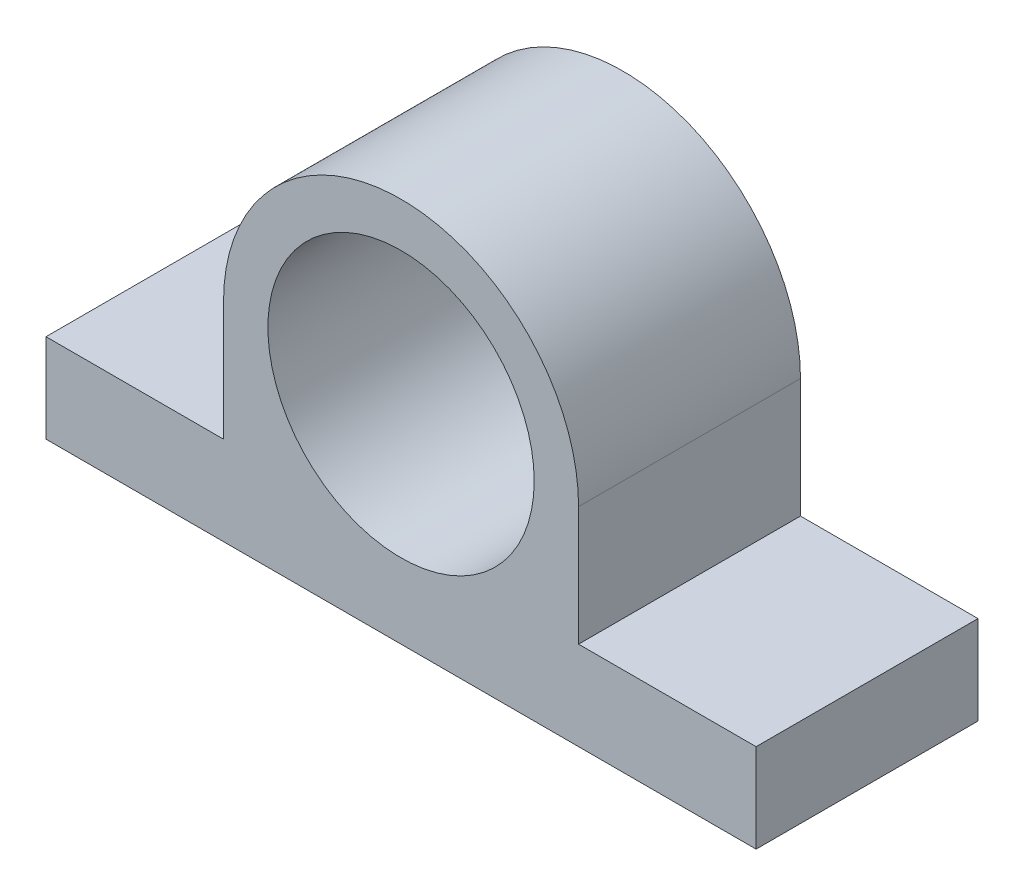
ISO-10303-21;
HEADER;
FILE_DESCRIPTION(('STEP AP214'),'2;1');
FILE_NAME('part.step','',(''),(''),'','','');
FILE_SCHEMA(('AUTOMOTIVE_DESIGN { 1 0 10303 214 1 1 1 1 }'));
ENDSEC;
DATA;
#1=APPLICATION_CONTEXT('core data for automotive mechanical design processes');
#2=APPLICATION_PROTOCOL_DEFINITION('international standard','automotive_design',2000,#1);
#3=PRODUCT_CONTEXT('',#1,'mechanical');
#4=PRODUCT('Part','Part','',(#3));
#5=PRODUCT_RELATED_PRODUCT_CATEGORY('part','',(#4));
#6=PRODUCT_DEFINITION_FORMATION('','',#4);
#7=PRODUCT_DEFINITION_CONTEXT('part definition',#1,'design');
#8=PRODUCT_DEFINITION('design','',#6,#7);
#9=PRODUCT_DEFINITION_SHAPE('','',#8);
#10=(LENGTH_UNIT() NAMED_UNIT(*) SI_UNIT(.MILLI.,.METRE.));
#11=(NAMED_UNIT(*) PLANE_ANGLE_UNIT() SI_UNIT($,.RADIAN.));
#12=(NAMED_UNIT(*) SI_UNIT($,.STERADIAN.) SOLID_ANGLE_UNIT());
#13=UNCERTAINTY_MEASURE_WITH_UNIT(LENGTH_MEASURE(1.E-05),#10,'distance_accuracy_value','');
#14=(GEOMETRIC_REPRESENTATION_CONTEXT(3) GLOBAL_UNCERTAINTY_ASSIGNED_CONTEXT((#13)) GLOBAL_UNIT_ASSIGNED_CONTEXT((#10,
#11,#12)) REPRESENTATION_CONTEXT('',''));
#15=CARTESIAN_POINT('',(0.,0.,0.));
#16=DIRECTION('',(0.,0.,1.));
#17=DIRECTION('',(1.,0.,0.));
#18=AXIS2_PLACEMENT_3D('',#15,#16,#17);
#19=CARTESIAN_POINT('',(0.,23.4199134199134,25.));
#20=DIRECTION('',(0.,0.,-1.));
#21=DIRECTION('',(-1.,0.,0.));
#22=AXIS2_PLACEMENT_3D('',#19,#20,#21);
#23=PLANE('',#22);
#24=DIRECTION('',(0.,-1.,0.));
#25=VECTOR('',#24,1.);
#26=CARTESIAN_POINT('',(-40.,0.,25.));
#27=LINE('',#26,#25);
#28=CARTESIAN_POINT('',(-40.,10.,25.));
#29=VERTEX_POINT('',#28);
#30=CARTESIAN_POINT('',(-40.,0.,25.));
#31=VERTEX_POINT('',#30);
#32=EDGE_CURVE('E151',#29,#31,#27,.T.);
#33=ORIENTED_EDGE('',*,*,#32,.T.);
#34=DIRECTION('',(1.,0.,0.));
#35=VECTOR('',#34,1.);
#36=CARTESIAN_POINT('',(40.,0.,25.));
#37=LINE('',#36,#35);
#38=CARTESIAN_POINT('',(40.,0.,25.));
#39=VERTEX_POINT('',#38);
#40=EDGE_CURVE('E99',#31,#39,#37,.T.);
#41=ORIENTED_EDGE('',*,*,#40,.T.);
#42=DIRECTION('',(0.,1.,0.));
#43=VECTOR('',#42,1.);
#44=CARTESIAN_POINT('',(40.,10.,25.));
#45=LINE('',#44,#43);
#46=CARTESIAN_POINT('',(40.,10.,25.));
#47=VERTEX_POINT('',#46);
#48=EDGE_CURVE('E166',#39,#47,#45,.T.);
#49=ORIENTED_EDGE('',*,*,#48,.T.);
#50=DIRECTION('',(-1.,0.,0.));
#51=VECTOR('',#50,1.);
#52=CARTESIAN_POINT('',(20.,10.,25.));
#53=LINE('',#52,#51);
#54=CARTESIAN_POINT('',(20.,10.,25.));
#55=VERTEX_POINT('',#54);
#56=EDGE_CURVE('E179',#47,#55,#53,.T.);
#57=ORIENTED_EDGE('',*,*,#56,.T.);
#58=DIRECTION('',(0.,1.,0.));
#59=VECTOR('',#58,1.);
#60=CARTESIAN_POINT('',(20.,23.4199134199134,25.));
#61=LINE('',#60,#59);
#62=CARTESIAN_POINT('',(20.,23.4199134199134,25.));
#63=VERTEX_POINT('',#62);
#64=EDGE_CURVE('E118',#55,#63,#61,.T.);
#65=ORIENTED_EDGE('',*,*,#64,.T.);
#66=CARTESIAN_POINT('',(0.,23.4199134199134,25.));
#67=DIRECTION('',(0.,0.,1.));
#68=DIRECTION('',(-1.,0.,0.));
#69=AXIS2_PLACEMENT_3D('',#66,#67,#68);
#70=CIRCLE('',#69,20.);
#71=CARTESIAN_POINT('',(-20.,23.4199134199134,25.));
#72=VERTEX_POINT('',#71);
#73=EDGE_CURVE('E112',#63,#72,#70,.T.);
#74=ORIENTED_EDGE('',*,*,#73,.T.);
#75=DIRECTION('',(0.,-1.,0.));
#76=VECTOR('',#75,1.);
#77=CARTESIAN_POINT('',(-20.,10.,25.));
#78=LINE('',#77,#76);
#79=CARTESIAN_POINT('',(-20.,10.,25.));
#80=VERTEX_POINT('',#79);
#81=EDGE_CURVE('E116',#72,#80,#78,.T.);
#82=ORIENTED_EDGE('',*,*,#81,.T.);
#83=DIRECTION('',(-1.,0.,0.));
#84=VECTOR('',#83,1.);
#85=CARTESIAN_POINT('',(-40.,10.,25.));
#86=LINE('',#85,#84);
#87=EDGE_CURVE('E56',#80,#29,#86,.T.);
#88=ORIENTED_EDGE('',*,*,#87,.T.);
#89=EDGE_LOOP('',(#33,#41,#49,#57,#65,#74,#82,#88));
#90=FACE_BOUND('',#89,.T.);
#91=CARTESIAN_POINT('',(0.,23.4199134199134,25.));
#92=DIRECTION('',(0.,0.,1.));
#93=DIRECTION('',(1.,0.,0.));
#94=AXIS2_PLACEMENT_3D('',#91,#92,#93);
#95=CIRCLE('',#94,15.);
#96=CARTESIAN_POINT('',(15.,23.4199134199134,25.));
#97=VERTEX_POINT('',#96);
#98=EDGE_CURVE('E140',#97,#97,#95,.T.);
#99=ORIENTED_EDGE('',*,*,#98,.F.);
#100=EDGE_LOOP('',(#99));
#101=FACE_BOUND('',#100,.T.);
#102=ADVANCED_FACE('F39',(#90,#101),#23,.F.);
#103=CARTESIAN_POINT('',(0.,23.4199134199134,0.));
#104=DIRECTION('',(0.,0.,-1.));
#105=DIRECTION('',(-1.,0.,0.));
#106=AXIS2_PLACEMENT_3D('',#103,#104,#105);
#107=PLANE('',#106);
#108=DIRECTION('',(0.,-1.,0.));
#109=VECTOR('',#108,1.);
#110=CARTESIAN_POINT('',(-40.,0.,0.));
#111=LINE('',#110,#109);
#112=CARTESIAN_POINT('',(-40.,10.,0.));
#113=VERTEX_POINT('',#112);
#114=CARTESIAN_POINT('',(-40.,0.,0.));
#115=VERTEX_POINT('',#114);
#116=EDGE_CURVE('E136',#113,#115,#111,.T.);
#117=ORIENTED_EDGE('',*,*,#116,.F.);
#118=DIRECTION('',(-1.,0.,0.));
#119=VECTOR('',#118,1.);
#120=CARTESIAN_POINT('',(-40.,10.,0.));
#121=LINE('',#120,#119);
#122=CARTESIAN_POINT('',(-20.,10.,0.));
#123=VERTEX_POINT('',#122);
#124=EDGE_CURVE('E91',#123,#113,#121,.T.);
#125=ORIENTED_EDGE('',*,*,#124,.F.);
#126=DIRECTION('',(0.,-1.,0.));
#127=VECTOR('',#126,1.);
#128=CARTESIAN_POINT('',(-20.,10.,0.));
#129=LINE('',#128,#127);
#130=CARTESIAN_POINT('',(-20.,23.4199134199134,0.));
#131=VERTEX_POINT('',#130);
#132=EDGE_CURVE('E85',#131,#123,#129,.T.);
#133=ORIENTED_EDGE('',*,*,#132,.F.);
#134=CARTESIAN_POINT('',(0.,23.4199134199134,0.));
#135=DIRECTION('',(0.,0.,1.));
#136=DIRECTION('',(-1.,0.,0.));
#137=AXIS2_PLACEMENT_3D('',#134,#135,#136);
#138=CIRCLE('',#137,20.);
#139=CARTESIAN_POINT('',(20.,23.4199134199134,0.));
#140=VERTEX_POINT('',#139);
#141=EDGE_CURVE('E126',#140,#131,#138,.T.);
#142=ORIENTED_EDGE('',*,*,#141,.F.);
#143=DIRECTION('',(0.,1.,0.));
#144=VECTOR('',#143,1.);
#145=CARTESIAN_POINT('',(20.,23.4199134199134,0.));
#146=LINE('',#145,#144);
#147=CARTESIAN_POINT('',(20.,10.,0.));
#148=VERTEX_POINT('',#147);
#149=EDGE_CURVE('E146',#148,#140,#146,.T.);
#150=ORIENTED_EDGE('',*,*,#149,.F.);
#151=DIRECTION('',(-1.,0.,0.));
#152=VECTOR('',#151,1.);
#153=CARTESIAN_POINT('',(20.,10.,0.));
#154=LINE('',#153,#152);
#155=CARTESIAN_POINT('',(40.,10.,0.));
#156=VERTEX_POINT('',#155);
#157=EDGE_CURVE('E144',#156,#148,#154,.T.);
#158=ORIENTED_EDGE('',*,*,#157,.F.);
#159=DIRECTION('',(0.,1.,0.));
#160=VECTOR('',#159,1.);
#161=CARTESIAN_POINT('',(40.,10.,0.));
#162=LINE('',#161,#160);
#163=CARTESIAN_POINT('',(40.,0.,0.));
#164=VERTEX_POINT('',#163);
#165=EDGE_CURVE('E142',#164,#156,#162,.T.);
#166=ORIENTED_EDGE('',*,*,#165,.F.);
#167=DIRECTION('',(1.,0.,0.));
#168=VECTOR('',#167,1.);
#169=CARTESIAN_POINT('',(40.,0.,0.));
#170=LINE('',#169,#168);
#171=EDGE_CURVE('E139',#115,#164,#170,.T.);
#172=ORIENTED_EDGE('',*,*,#171,.F.);
#173=EDGE_LOOP('',(#117,#125,#133,#142,#150,#158,#166,#172));
#174=FACE_BOUND('',#173,.T.);
#175=CARTESIAN_POINT('',(0.,23.4199134199134,0.));
#176=DIRECTION('',(0.,0.,1.));
#177=DIRECTION('',(1.,0.,0.));
#178=AXIS2_PLACEMENT_3D('',#175,#176,#177);
#179=CIRCLE('',#178,15.);
#180=CARTESIAN_POINT('',(15.,23.4199134199134,0.));
#181=VERTEX_POINT('',#180);
#182=EDGE_CURVE('E185',#181,#181,#179,.T.);
#183=ORIENTED_EDGE('',*,*,#182,.T.);
#184=EDGE_LOOP('',(#183));
#185=FACE_BOUND('',#184,.T.);
#186=ADVANCED_FACE('F170',(#174,#185),#107,.T.);
#187=CARTESIAN_POINT('',(-40.,0.,25.));
#188=DIRECTION('',(1.,0.,0.));
#189=DIRECTION('',(0.,0.,-1.));
#190=AXIS2_PLACEMENT_3D('',#187,#188,#189);
#191=PLANE('',#190);
#192=ORIENTED_EDGE('',*,*,#116,.T.);
#193=DIRECTION('',(0.,0.,-1.));
#194=VECTOR('',#193,1.);
#195=CARTESIAN_POINT('',(-40.,0.,25.));
#196=LINE('',#195,#194);
#197=EDGE_CURVE('E11',#31,#115,#196,.T.);
#198=ORIENTED_EDGE('',*,*,#197,.F.);
#199=ORIENTED_EDGE('',*,*,#32,.F.);
#200=DIRECTION('',(0.,0.,-1.));
#201=VECTOR('',#200,1.);
#202=CARTESIAN_POINT('',(-40.,10.,25.));
#203=LINE('',#202,#201);
#204=EDGE_CURVE('E132',#29,#113,#203,.T.);
#205=ORIENTED_EDGE('',*,*,#204,.T.);
#206=EDGE_LOOP('',(#192,#198,#199,#205));
#207=FACE_BOUND('',#206,.T.);
#208=ADVANCED_FACE('F41',(#207),#191,.F.);
#209=CARTESIAN_POINT('',(40.,0.,25.));
#210=DIRECTION('',(0.,1.,0.));
#211=DIRECTION('',(0.,0.,1.));
#212=AXIS2_PLACEMENT_3D('',#209,#210,#211);
#213=PLANE('',#212);
#214=ORIENTED_EDGE('',*,*,#171,.T.);
#215=DIRECTION('',(0.,0.,-1.));
#216=VECTOR('',#215,1.);
#217=CARTESIAN_POINT('',(40.,0.,25.));
#218=LINE('',#217,#216);
#219=EDGE_CURVE('E48',#39,#164,#218,.T.);
#220=ORIENTED_EDGE('',*,*,#219,.F.);
#221=ORIENTED_EDGE('',*,*,#40,.F.);
#222=ORIENTED_EDGE('',*,*,#197,.T.);
#223=EDGE_LOOP('',(#214,#220,#221,#222));
#224=FACE_BOUND('',#223,.T.);
#225=ADVANCED_FACE('F213',(#224),#213,.F.);
#226=CARTESIAN_POINT('',(40.,10.,25.));
#227=DIRECTION('',(-1.,0.,0.));
#228=DIRECTION('',(0.,0.,1.));
#229=AXIS2_PLACEMENT_3D('',#226,#227,#228);
#230=PLANE('',#229);
#231=ORIENTED_EDGE('',*,*,#165,.T.);
#232=DIRECTION('',(0.,0.,-1.));
#233=VECTOR('',#232,1.);
#234=CARTESIAN_POINT('',(40.,10.,25.));
#235=LINE('',#234,#233);
#236=EDGE_CURVE('E158',#47,#156,#235,.T.);
#237=ORIENTED_EDGE('',*,*,#236,.F.);
#238=ORIENTED_EDGE('',*,*,#48,.F.);
#239=ORIENTED_EDGE('',*,*,#219,.T.);
#240=EDGE_LOOP('',(#231,#237,#238,#239));
#241=FACE_BOUND('',#240,.T.);
#242=ADVANCED_FACE('F164',(#241),#230,.F.);
#243=CARTESIAN_POINT('',(20.,10.,25.));
#244=DIRECTION('',(0.,-1.,0.));
#245=DIRECTION('',(0.,0.,-1.));
#246=AXIS2_PLACEMENT_3D('',#243,#244,#245);
#247=PLANE('',#246);
#248=ORIENTED_EDGE('',*,*,#157,.T.);
#249=DIRECTION('',(0.,0.,-1.));
#250=VECTOR('',#249,1.);
#251=CARTESIAN_POINT('',(20.,10.,25.));
#252=LINE('',#251,#250);
#253=EDGE_CURVE('E155',#55,#148,#252,.T.);
#254=ORIENTED_EDGE('',*,*,#253,.F.);
#255=ORIENTED_EDGE('',*,*,#56,.F.);
#256=ORIENTED_EDGE('',*,*,#236,.T.);
#257=EDGE_LOOP('',(#248,#254,#255,#256));
#258=FACE_BOUND('',#257,.T.);
#259=ADVANCED_FACE('F175',(#258),#247,.F.);
#260=CARTESIAN_POINT('',(20.,23.4199134199134,25.));
#261=DIRECTION('',(-1.,0.,0.));
#262=DIRECTION('',(0.,0.,1.));
#263=AXIS2_PLACEMENT_3D('',#260,#261,#262);
#264=PLANE('',#263);
#265=ORIENTED_EDGE('',*,*,#149,.T.);
#266=DIRECTION('',(0.,0.,-1.));
#267=VECTOR('',#266,1.);
#268=CARTESIAN_POINT('',(20.,23.4199134199134,25.));
#269=LINE('',#268,#267);
#270=EDGE_CURVE('E127',#63,#140,#269,.T.);
#271=ORIENTED_EDGE('',*,*,#270,.F.);
#272=ORIENTED_EDGE('',*,*,#64,.F.);
#273=ORIENTED_EDGE('',*,*,#253,.T.);
#274=EDGE_LOOP('',(#265,#271,#272,#273));
#275=FACE_BOUND('',#274,.T.);
#276=ADVANCED_FACE('F178',(#275),#264,.F.);
#277=CARTESIAN_POINT('',(0.,23.4199134199134,25.));
#278=DIRECTION('',(0.,0.,-1.));
#279=DIRECTION('',(-1.,0.,0.));
#280=AXIS2_PLACEMENT_3D('',#277,#278,#279);
#281=CYLINDRICAL_SURFACE('',#280,20.);
#282=ORIENTED_EDGE('',*,*,#141,.T.);
#283=DIRECTION('',(0.,0.,-1.));
#284=VECTOR('',#283,1.);
#285=CARTESIAN_POINT('',(-20.,23.4199134199134,25.));
#286=LINE('',#285,#284);
#287=EDGE_CURVE('E123',#72,#131,#286,.T.);
#288=ORIENTED_EDGE('',*,*,#287,.F.);
#289=ORIENTED_EDGE('',*,*,#73,.F.);
#290=ORIENTED_EDGE('',*,*,#270,.T.);
#291=EDGE_LOOP('',(#282,#288,#289,#290));
#292=FACE_BOUND('',#291,.T.);
#293=ADVANCED_FACE('F124',(#292),#281,.T.);
#294=CARTESIAN_POINT('',(-20.,10.,25.));
#295=DIRECTION('',(1.,0.,0.));
#296=DIRECTION('',(0.,0.,-1.));
#297=AXIS2_PLACEMENT_3D('',#294,#295,#296);
#298=PLANE('',#297);
#299=ORIENTED_EDGE('',*,*,#132,.T.);
#300=DIRECTION('',(0.,0.,-1.));
#301=VECTOR('',#300,1.);
#302=CARTESIAN_POINT('',(-20.,10.,25.));
#303=LINE('',#302,#301);
#304=EDGE_CURVE('E128',#80,#123,#303,.T.);
#305=ORIENTED_EDGE('',*,*,#304,.F.);
#306=ORIENTED_EDGE('',*,*,#81,.F.);
#307=ORIENTED_EDGE('',*,*,#287,.T.);
#308=EDGE_LOOP('',(#299,#305,#306,#307));
#309=FACE_BOUND('',#308,.T.);
#310=ADVANCED_FACE('F130',(#309),#298,.F.);
#311=CARTESIAN_POINT('',(-40.,10.,25.));
#312=DIRECTION('',(0.,-1.,0.));
#313=DIRECTION('',(0.,0.,-1.));
#314=AXIS2_PLACEMENT_3D('',#311,#312,#313);
#315=PLANE('',#314);
#316=ORIENTED_EDGE('',*,*,#124,.T.);
#317=ORIENTED_EDGE('',*,*,#204,.F.);
#318=ORIENTED_EDGE('',*,*,#87,.F.);
#319=ORIENTED_EDGE('',*,*,#304,.T.);
#320=EDGE_LOOP('',(#316,#317,#318,#319));
#321=FACE_BOUND('',#320,.T.);
#322=ADVANCED_FACE('F201',(#321),#315,.F.);
#323=CARTESIAN_POINT('',(0.,23.4199134199134,25.));
#324=DIRECTION('',(0.,0.,-1.));
#325=DIRECTION('',(-1.,0.,0.));
#326=AXIS2_PLACEMENT_3D('',#323,#324,#325);
#327=CYLINDRICAL_SURFACE('',#326,15.);
#328=ORIENTED_EDGE('',*,*,#98,.T.);
#329=EDGE_LOOP('',(#328));
#330=FACE_BOUND('',#329,.T.);
#331=ORIENTED_EDGE('',*,*,#182,.F.);
#332=EDGE_LOOP('',(#331));
#333=FACE_BOUND('',#332,.T.);
#334=ADVANCED_FACE('F191',(#330,#333),#327,.F.);
#335=CLOSED_SHELL('',(#102,#186,#208,#225,#242,#259,#276,#293,#310,#322,#334));
#336=MANIFOLD_SOLID_BREP('B2',#335);
#337=ADVANCED_BREP_SHAPE_REPRESENTATION('',(#18,#336),#14);
#338=SHAPE_DEFINITION_REPRESENTATION(#9,#337);
ENDSEC;
END-ISO-10303-21;
